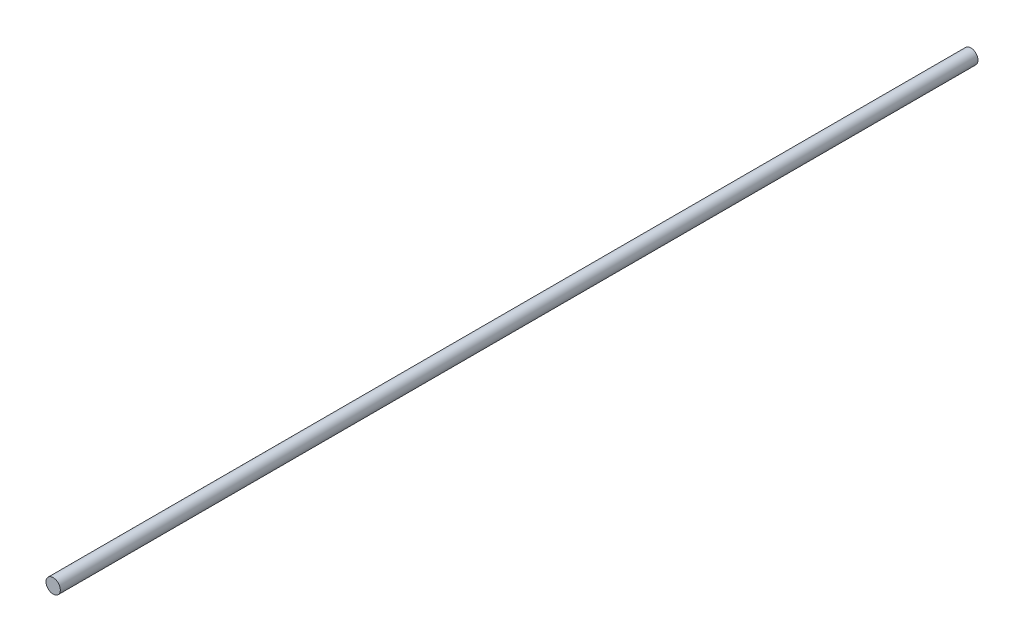
ISO-10303-21;
HEADER;
FILE_DESCRIPTION(('STEP AP214'),'2;1');
FILE_NAME('part.step','',(''),(''),'','','');
FILE_SCHEMA(('AUTOMOTIVE_DESIGN { 1 0 10303 214 1 1 1 1 }'));
ENDSEC;
DATA;
#1=APPLICATION_CONTEXT('core data for automotive mechanical design processes');
#2=APPLICATION_PROTOCOL_DEFINITION('international standard','automotive_design',2000,#1);
#3=PRODUCT_CONTEXT('',#1,'mechanical');
#4=PRODUCT('Part','Part','',(#3));
#5=PRODUCT_RELATED_PRODUCT_CATEGORY('part','',(#4));
#6=PRODUCT_DEFINITION_FORMATION('','',#4);
#7=PRODUCT_DEFINITION_CONTEXT('part definition',#1,'design');
#8=PRODUCT_DEFINITION('design','',#6,#7);
#9=PRODUCT_DEFINITION_SHAPE('','',#8);
#10=(LENGTH_UNIT() NAMED_UNIT(*) SI_UNIT(.MILLI.,.METRE.));
#11=(NAMED_UNIT(*) PLANE_ANGLE_UNIT() SI_UNIT($,.RADIAN.));
#12=(NAMED_UNIT(*) SI_UNIT($,.STERADIAN.) SOLID_ANGLE_UNIT());
#13=UNCERTAINTY_MEASURE_WITH_UNIT(LENGTH_MEASURE(1.E-05),#10,'distance_accuracy_value','');
#14=(GEOMETRIC_REPRESENTATION_CONTEXT(3) GLOBAL_UNCERTAINTY_ASSIGNED_CONTEXT((#13)) GLOBAL_UNIT_ASSIGNED_CONTEXT((#10,
#11,#12)) REPRESENTATION_CONTEXT('',''));
#15=CARTESIAN_POINT('',(0.,0.,0.));
#16=DIRECTION('',(0.,0.,1.));
#17=DIRECTION('',(1.,0.,0.));
#18=AXIS2_PLACEMENT_3D('',#15,#16,#17);
#19=CARTESIAN_POINT('',(0.,0.,406.4));
#20=DIRECTION('',(0.,0.,-1.));
#21=DIRECTION('',(-1.,0.,0.));
#22=AXIS2_PLACEMENT_3D('',#19,#20,#21);
#23=CYLINDRICAL_SURFACE('',#22,3.175);
#24=CARTESIAN_POINT('',(0.,0.,406.4));
#25=DIRECTION('',(0.,0.,1.));
#26=DIRECTION('',(1.,0.,0.));
#27=AXIS2_PLACEMENT_3D('',#24,#25,#26);
#28=CIRCLE('',#27,3.175);
#29=CARTESIAN_POINT('',(3.175,0.,406.4));
#30=VERTEX_POINT('',#29);
#31=EDGE_CURVE('E10',#30,#30,#28,.T.);
#32=ORIENTED_EDGE('',*,*,#31,.F.);
#33=EDGE_LOOP('',(#32));
#34=FACE_BOUND('',#33,.T.);
#35=CARTESIAN_POINT('',(0.,0.,0.));
#36=DIRECTION('',(0.,0.,1.));
#37=DIRECTION('',(1.,0.,0.));
#38=AXIS2_PLACEMENT_3D('',#35,#36,#37);
#39=CIRCLE('',#38,3.175);
#40=CARTESIAN_POINT('',(3.175,0.,0.));
#41=VERTEX_POINT('',#40);
#42=EDGE_CURVE('E34',#41,#41,#39,.T.);
#43=ORIENTED_EDGE('',*,*,#42,.T.);
#44=EDGE_LOOP('',(#43));
#45=FACE_BOUND('',#44,.T.);
#46=ADVANCED_FACE('F31',(#34,#45),#23,.T.);
#47=CARTESIAN_POINT('',(0.,0.,406.4));
#48=DIRECTION('',(0.,0.,1.));
#49=DIRECTION('',(1.,0.,0.));
#50=AXIS2_PLACEMENT_3D('',#47,#48,#49);
#51=PLANE('',#50);
#52=ORIENTED_EDGE('',*,*,#31,.T.);
#53=EDGE_LOOP('',(#52));
#54=FACE_BOUND('',#53,.T.);
#55=ADVANCED_FACE('F46',(#54),#51,.T.);
#56=CARTESIAN_POINT('',(0.,0.,0.));
#57=DIRECTION('',(0.,0.,1.));
#58=DIRECTION('',(1.,0.,0.));
#59=AXIS2_PLACEMENT_3D('',#56,#57,#58);
#60=PLANE('',#59);
#61=ORIENTED_EDGE('',*,*,#42,.F.);
#62=EDGE_LOOP('',(#61));
#63=FACE_BOUND('',#62,.T.);
#64=ADVANCED_FACE('F44',(#63),#60,.F.);
#65=CLOSED_SHELL('',(#46,#55,#64));
#66=MANIFOLD_SOLID_BREP('B2',#65);
#67=ADVANCED_BREP_SHAPE_REPRESENTATION('',(#18,#66),#14);
#68=SHAPE_DEFINITION_REPRESENTATION(#9,#67);
ENDSEC;
END-ISO-10303-21;
